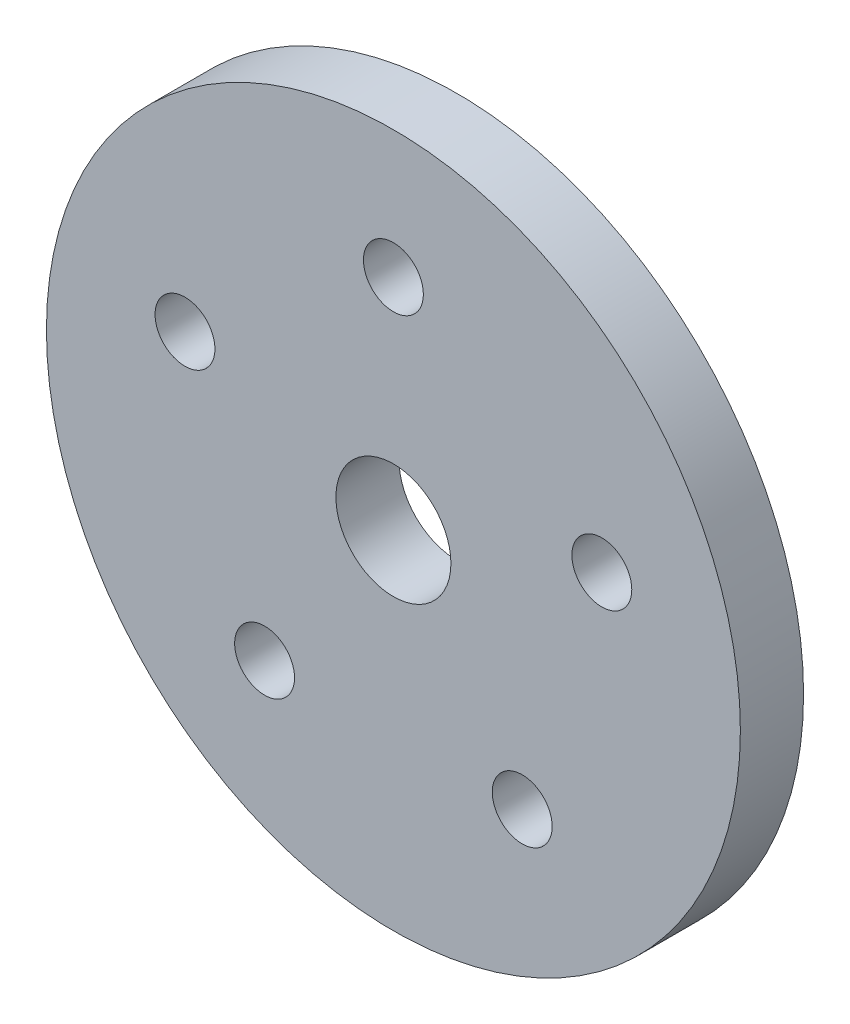
ISO-10303-21;
HEADER;
FILE_DESCRIPTION(('STEP AP214'),'2;1');
FILE_NAME('part.step','',(''),(''),'','','');
FILE_SCHEMA(('AUTOMOTIVE_DESIGN { 1 0 10303 214 1 1 1 1 }'));
ENDSEC;
DATA;
#1=APPLICATION_CONTEXT('core data for automotive mechanical design processes');
#2=APPLICATION_PROTOCOL_DEFINITION('international standard','automotive_design',2000,#1);
#3=PRODUCT_CONTEXT('',#1,'mechanical');
#4=PRODUCT('Part','Part','',(#3));
#5=PRODUCT_RELATED_PRODUCT_CATEGORY('part','',(#4));
#6=PRODUCT_DEFINITION_FORMATION('','',#4);
#7=PRODUCT_DEFINITION_CONTEXT('part definition',#1,'design');
#8=PRODUCT_DEFINITION('design','',#6,#7);
#9=PRODUCT_DEFINITION_SHAPE('','',#8);
#10=(LENGTH_UNIT() NAMED_UNIT(*) SI_UNIT(.MILLI.,.METRE.));
#11=(NAMED_UNIT(*) PLANE_ANGLE_UNIT() SI_UNIT($,.RADIAN.));
#12=(NAMED_UNIT(*) SI_UNIT($,.STERADIAN.) SOLID_ANGLE_UNIT());
#13=UNCERTAINTY_MEASURE_WITH_UNIT(LENGTH_MEASURE(1.E-05),#10,'distance_accuracy_value','');
#14=(GEOMETRIC_REPRESENTATION_CONTEXT(3) GLOBAL_UNCERTAINTY_ASSIGNED_CONTEXT((#13)) GLOBAL_UNIT_ASSIGNED_CONTEXT((#10,
#11,#12)) REPRESENTATION_CONTEXT('',''));
#15=CARTESIAN_POINT('',(0.,0.,0.));
#16=DIRECTION('',(0.,0.,1.));
#17=DIRECTION('',(1.,0.,0.));
#18=AXIS2_PLACEMENT_3D('',#15,#16,#17);
#19=CARTESIAN_POINT('',(0.,0.,4.3942));
#20=DIRECTION('',(0.,0.,1.));
#21=DIRECTION('',(1.,0.,0.));
#22=AXIS2_PLACEMENT_3D('',#19,#20,#21);
#23=PLANE('',#22);
#24=CARTESIAN_POINT('',(-8.95784724493651,-12.3294189942745,4.3942));
#25=DIRECTION('',(0.,0.,1.));
#26=DIRECTION('',(1.,0.,0.));
#27=AXIS2_PLACEMENT_3D('',#24,#25,#26);
#28=CIRCLE('',#27,2.0828);
#29=CARTESIAN_POINT('',(-6.87504724493651,-12.3294189942745,4.3942));
#30=VERTEX_POINT('',#29);
#31=EDGE_CURVE('E65',#30,#30,#28,.T.);
#32=ORIENTED_EDGE('',*,*,#31,.F.);
#33=EDGE_LOOP('',(#32));
#34=FACE_BOUND('',#33,.T.);
#35=CARTESIAN_POINT('',(14.4941013083382,4.70941899427416,4.3942));
#36=DIRECTION('',(0.,0.,1.));
#37=DIRECTION('',(1.,0.,0.));
#38=AXIS2_PLACEMENT_3D('',#35,#36,#37);
#39=CIRCLE('',#38,2.0828);
#40=CARTESIAN_POINT('',(16.5769013083382,4.70941899427416,4.3942));
#41=VERTEX_POINT('',#40);
#42=EDGE_CURVE('E53',#41,#41,#39,.T.);
#43=ORIENTED_EDGE('',*,*,#42,.F.);
#44=EDGE_LOOP('',(#43));
#45=FACE_BOUND('',#44,.T.);
#46=CARTESIAN_POINT('',(0.,15.24,4.3942));
#47=DIRECTION('',(0.,0.,1.));
#48=DIRECTION('',(1.,0.,0.));
#49=AXIS2_PLACEMENT_3D('',#46,#47,#48);
#50=CIRCLE('',#49,2.0828);
#51=CARTESIAN_POINT('',(2.0828,15.24,4.3942));
#52=VERTEX_POINT('',#51);
#53=EDGE_CURVE('E42',#52,#52,#50,.T.);
#54=ORIENTED_EDGE('',*,*,#53,.F.);
#55=EDGE_LOOP('',(#54));
#56=FACE_BOUND('',#55,.T.);
#57=CARTESIAN_POINT('',(0.,0.,4.3942));
#58=DIRECTION('',(0.,0.,1.));
#59=DIRECTION('',(1.,0.,0.));
#60=AXIS2_PLACEMENT_3D('',#57,#58,#59);
#61=CIRCLE('',#60,24.13);
#62=CARTESIAN_POINT('',(24.13,0.,4.3942));
#63=VERTEX_POINT('',#62);
#64=EDGE_CURVE('E10',#63,#63,#61,.T.);
#65=ORIENTED_EDGE('',*,*,#64,.T.);
#66=EDGE_LOOP('',(#65));
#67=FACE_BOUND('',#66,.T.);
#68=CARTESIAN_POINT('',(0.,0.,4.3942));
#69=DIRECTION('',(0.,0.,1.));
#70=DIRECTION('',(1.,0.,0.));
#71=AXIS2_PLACEMENT_3D('',#68,#69,#70);
#72=CIRCLE('',#71,4.);
#73=CARTESIAN_POINT('',(4.,0.,4.3942));
#74=VERTEX_POINT('',#73);
#75=EDGE_CURVE('E47',#74,#74,#72,.T.);
#76=ORIENTED_EDGE('',*,*,#75,.F.);
#77=EDGE_LOOP('',(#76));
#78=FACE_BOUND('',#77,.T.);
#79=CARTESIAN_POINT('',(8.95784724493807,-12.3294189942739,4.3942));
#80=DIRECTION('',(0.,0.,1.));
#81=DIRECTION('',(1.,0.,0.));
#82=AXIS2_PLACEMENT_3D('',#79,#80,#81);
#83=CIRCLE('',#82,2.0828);
#84=CARTESIAN_POINT('',(11.0406472449381,-12.3294189942739,4.3942));
#85=VERTEX_POINT('',#84);
#86=EDGE_CURVE('E59',#85,#85,#83,.T.);
#87=ORIENTED_EDGE('',*,*,#86,.F.);
#88=EDGE_LOOP('',(#87));
#89=FACE_BOUND('',#88,.T.);
#90=CARTESIAN_POINT('',(-14.4941013083378,4.70941899427379,4.3942));
#91=DIRECTION('',(0.,0.,1.));
#92=DIRECTION('',(1.,0.,0.));
#93=AXIS2_PLACEMENT_3D('',#90,#91,#92);
#94=CIRCLE('',#93,2.0828);
#95=CARTESIAN_POINT('',(-12.4113013083378,4.70941899427379,4.3942));
#96=VERTEX_POINT('',#95);
#97=EDGE_CURVE('E71',#96,#96,#94,.T.);
#98=ORIENTED_EDGE('',*,*,#97,.F.);
#99=EDGE_LOOP('',(#98));
#100=FACE_BOUND('',#99,.T.);
#101=ADVANCED_FACE('F31',(#34,#45,#56,#67,#78,#89,#100),#23,.T.);
#102=CARTESIAN_POINT('',(0.,0.,0.));
#103=DIRECTION('',(0.,0.,1.));
#104=DIRECTION('',(1.,0.,0.));
#105=AXIS2_PLACEMENT_3D('',#102,#103,#104);
#106=PLANE('',#105);
#107=CARTESIAN_POINT('',(-8.95784724493651,-12.3294189942745,0.));
#108=DIRECTION('',(0.,0.,1.));
#109=DIRECTION('',(1.,0.,0.));
#110=AXIS2_PLACEMENT_3D('',#107,#108,#109);
#111=CIRCLE('',#110,2.0828);
#112=CARTESIAN_POINT('',(-6.87504724493651,-12.3294189942745,0.));
#113=VERTEX_POINT('',#112);
#114=EDGE_CURVE('E68',#113,#113,#111,.T.);
#115=ORIENTED_EDGE('',*,*,#114,.T.);
#116=EDGE_LOOP('',(#115));
#117=FACE_BOUND('',#116,.T.);
#118=CARTESIAN_POINT('',(14.4941013083382,4.70941899427416,0.));
#119=DIRECTION('',(0.,0.,1.));
#120=DIRECTION('',(1.,0.,0.));
#121=AXIS2_PLACEMENT_3D('',#118,#119,#120);
#122=CIRCLE('',#121,2.0828);
#123=CARTESIAN_POINT('',(16.5769013083382,4.70941899427416,0.));
#124=VERTEX_POINT('',#123);
#125=EDGE_CURVE('E56',#124,#124,#122,.T.);
#126=ORIENTED_EDGE('',*,*,#125,.T.);
#127=EDGE_LOOP('',(#126));
#128=FACE_BOUND('',#127,.T.);
#129=CARTESIAN_POINT('',(0.,15.24,0.));
#130=DIRECTION('',(0.,0.,1.));
#131=DIRECTION('',(1.,0.,0.));
#132=AXIS2_PLACEMENT_3D('',#129,#130,#131);
#133=CIRCLE('',#132,2.0828);
#134=CARTESIAN_POINT('',(2.0828,15.24,0.));
#135=VERTEX_POINT('',#134);
#136=EDGE_CURVE('E44',#135,#135,#133,.T.);
#137=ORIENTED_EDGE('',*,*,#136,.T.);
#138=EDGE_LOOP('',(#137));
#139=FACE_BOUND('',#138,.T.);
#140=CARTESIAN_POINT('',(0.,0.,0.));
#141=DIRECTION('',(0.,0.,1.));
#142=DIRECTION('',(1.,0.,0.));
#143=AXIS2_PLACEMENT_3D('',#140,#141,#142);
#144=CIRCLE('',#143,24.13);
#145=CARTESIAN_POINT('',(24.13,0.,0.));
#146=VERTEX_POINT('',#145);
#147=EDGE_CURVE('E35',#146,#146,#144,.T.);
#148=ORIENTED_EDGE('',*,*,#147,.F.);
#149=EDGE_LOOP('',(#148));
#150=FACE_BOUND('',#149,.T.);
#151=CARTESIAN_POINT('',(0.,0.,0.));
#152=DIRECTION('',(0.,0.,1.));
#153=DIRECTION('',(1.,0.,0.));
#154=AXIS2_PLACEMENT_3D('',#151,#152,#153);
#155=CIRCLE('',#154,4.);
#156=CARTESIAN_POINT('',(4.,0.,0.));
#157=VERTEX_POINT('',#156);
#158=EDGE_CURVE('E50',#157,#157,#155,.T.);
#159=ORIENTED_EDGE('',*,*,#158,.T.);
#160=EDGE_LOOP('',(#159));
#161=FACE_BOUND('',#160,.T.);
#162=CARTESIAN_POINT('',(8.95784724493807,-12.3294189942739,0.));
#163=DIRECTION('',(0.,0.,1.));
#164=DIRECTION('',(1.,0.,0.));
#165=AXIS2_PLACEMENT_3D('',#162,#163,#164);
#166=CIRCLE('',#165,2.0828);
#167=CARTESIAN_POINT('',(11.0406472449381,-12.3294189942739,0.));
#168=VERTEX_POINT('',#167);
#169=EDGE_CURVE('E62',#168,#168,#166,.T.);
#170=ORIENTED_EDGE('',*,*,#169,.T.);
#171=EDGE_LOOP('',(#170));
#172=FACE_BOUND('',#171,.T.);
#173=CARTESIAN_POINT('',(-14.4941013083378,4.70941899427379,0.));
#174=DIRECTION('',(0.,0.,1.));
#175=DIRECTION('',(1.,0.,0.));
#176=AXIS2_PLACEMENT_3D('',#173,#174,#175);
#177=CIRCLE('',#176,2.0828);
#178=CARTESIAN_POINT('',(-12.4113013083378,4.70941899427379,0.));
#179=VERTEX_POINT('',#178);
#180=EDGE_CURVE('E74',#179,#179,#177,.T.);
#181=ORIENTED_EDGE('',*,*,#180,.T.);
#182=EDGE_LOOP('',(#181));
#183=FACE_BOUND('',#182,.T.);
#184=ADVANCED_FACE('F84',(#117,#128,#139,#150,#161,#172,#183),#106,.F.);
#185=CARTESIAN_POINT('',(0.,0.,4.3942));
#186=DIRECTION('',(0.,0.,-1.));
#187=DIRECTION('',(-1.,0.,0.));
#188=AXIS2_PLACEMENT_3D('',#185,#186,#187);
#189=CYLINDRICAL_SURFACE('',#188,24.13);
#190=ORIENTED_EDGE('',*,*,#64,.F.);
#191=EDGE_LOOP('',(#190));
#192=FACE_BOUND('',#191,.T.);
#193=ORIENTED_EDGE('',*,*,#147,.T.);
#194=EDGE_LOOP('',(#193));
#195=FACE_BOUND('',#194,.T.);
#196=ADVANCED_FACE('F33',(#192,#195),#189,.T.);
#197=CARTESIAN_POINT('',(0.,15.24,4.3942));
#198=DIRECTION('',(0.,0.,-1.));
#199=DIRECTION('',(-1.,0.,0.));
#200=AXIS2_PLACEMENT_3D('',#197,#198,#199);
#201=CYLINDRICAL_SURFACE('',#200,2.0828);
#202=ORIENTED_EDGE('',*,*,#53,.T.);
#203=EDGE_LOOP('',(#202));
#204=FACE_BOUND('',#203,.T.);
#205=ORIENTED_EDGE('',*,*,#136,.F.);
#206=EDGE_LOOP('',(#205));
#207=FACE_BOUND('',#206,.T.);
#208=ADVANCED_FACE('F94',(#204,#207),#201,.F.);
#209=CARTESIAN_POINT('',(0.,0.,4.3942));
#210=DIRECTION('',(0.,0.,-1.));
#211=DIRECTION('',(-1.,0.,0.));
#212=AXIS2_PLACEMENT_3D('',#209,#210,#211);
#213=CYLINDRICAL_SURFACE('',#212,4.);
#214=ORIENTED_EDGE('',*,*,#75,.T.);
#215=EDGE_LOOP('',(#214));
#216=FACE_BOUND('',#215,.T.);
#217=ORIENTED_EDGE('',*,*,#158,.F.);
#218=EDGE_LOOP('',(#217));
#219=FACE_BOUND('',#218,.T.);
#220=ADVANCED_FACE('F97',(#216,#219),#213,.F.);
#221=CARTESIAN_POINT('',(14.4941013083382,4.70941899427416,4.3942));
#222=DIRECTION('',(0.,0.,-1.));
#223=DIRECTION('',(-1.,0.,0.));
#224=AXIS2_PLACEMENT_3D('',#221,#222,#223);
#225=CYLINDRICAL_SURFACE('',#224,2.0828);
#226=ORIENTED_EDGE('',*,*,#42,.T.);
#227=EDGE_LOOP('',(#226));
#228=FACE_BOUND('',#227,.T.);
#229=ORIENTED_EDGE('',*,*,#125,.F.);
#230=EDGE_LOOP('',(#229));
#231=FACE_BOUND('',#230,.T.);
#232=ADVANCED_FACE('F101',(#228,#231),#225,.F.);
#233=CARTESIAN_POINT('',(8.95784724493807,-12.3294189942739,4.3942));
#234=DIRECTION('',(0.,0.,-1.));
#235=DIRECTION('',(-1.,0.,0.));
#236=AXIS2_PLACEMENT_3D('',#233,#234,#235);
#237=CYLINDRICAL_SURFACE('',#236,2.0828);
#238=ORIENTED_EDGE('',*,*,#86,.T.);
#239=EDGE_LOOP('',(#238));
#240=FACE_BOUND('',#239,.T.);
#241=ORIENTED_EDGE('',*,*,#169,.F.);
#242=EDGE_LOOP('',(#241));
#243=FACE_BOUND('',#242,.T.);
#244=ADVANCED_FACE('F105',(#240,#243),#237,.F.);
#245=CARTESIAN_POINT('',(-8.95784724493651,-12.3294189942745,4.3942));
#246=DIRECTION('',(0.,0.,-1.));
#247=DIRECTION('',(-1.,0.,0.));
#248=AXIS2_PLACEMENT_3D('',#245,#246,#247);
#249=CYLINDRICAL_SURFACE('',#248,2.0828);
#250=ORIENTED_EDGE('',*,*,#31,.T.);
#251=EDGE_LOOP('',(#250));
#252=FACE_BOUND('',#251,.T.);
#253=ORIENTED_EDGE('',*,*,#114,.F.);
#254=EDGE_LOOP('',(#253));
#255=FACE_BOUND('',#254,.T.);
#256=ADVANCED_FACE('F109',(#252,#255),#249,.F.);
#257=CARTESIAN_POINT('',(-14.4941013083378,4.70941899427379,4.3942));
#258=DIRECTION('',(0.,0.,-1.));
#259=DIRECTION('',(-1.,0.,0.));
#260=AXIS2_PLACEMENT_3D('',#257,#258,#259);
#261=CYLINDRICAL_SURFACE('',#260,2.0828);
#262=ORIENTED_EDGE('',*,*,#97,.T.);
#263=EDGE_LOOP('',(#262));
#264=FACE_BOUND('',#263,.T.);
#265=ORIENTED_EDGE('',*,*,#180,.F.);
#266=EDGE_LOOP('',(#265));
#267=FACE_BOUND('',#266,.T.);
#268=ADVANCED_FACE('F80',(#264,#267),#261,.F.);
#269=CLOSED_SHELL('',(#101,#184,#196,#208,#220,#232,#244,#256,#268));
#270=MANIFOLD_SOLID_BREP('B2',#269);
#271=ADVANCED_BREP_SHAPE_REPRESENTATION('',(#18,#270),#14);
#272=SHAPE_DEFINITION_REPRESENTATION(#9,#271);
ENDSEC;
END-ISO-10303-21;
